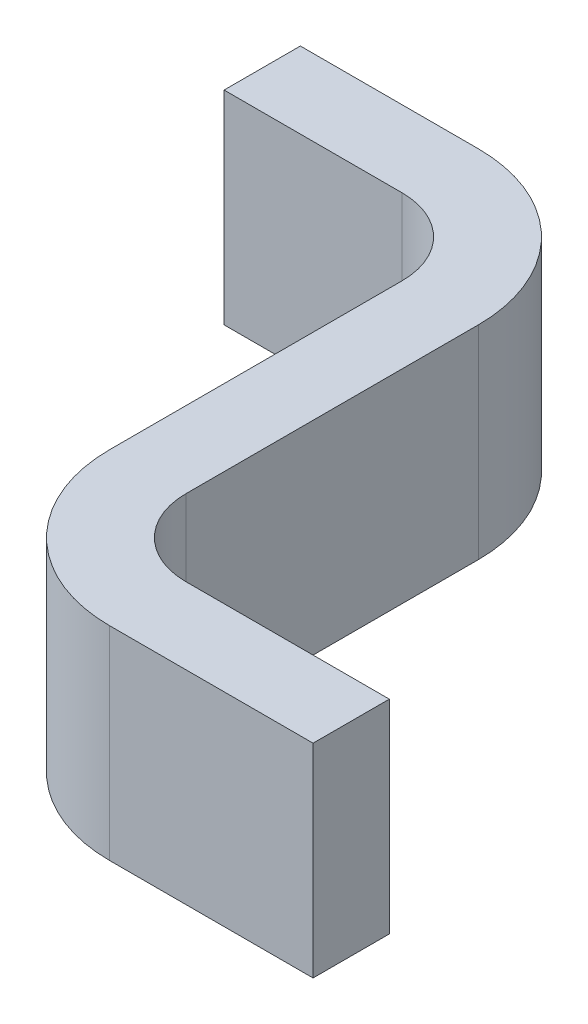
ISO-10303-21;
HEADER;
FILE_DESCRIPTION(('STEP AP214'),'2;1');
FILE_NAME('part.step','',(''),(''),'','','');
FILE_SCHEMA(('AUTOMOTIVE_DESIGN { 1 0 10303 214 1 1 1 1 }'));
ENDSEC;
DATA;
#1=APPLICATION_CONTEXT('core data for automotive mechanical design processes');
#2=APPLICATION_PROTOCOL_DEFINITION('international standard','automotive_design',2000,#1);
#3=PRODUCT_CONTEXT('',#1,'mechanical');
#4=PRODUCT('Part','Part','',(#3));
#5=PRODUCT_RELATED_PRODUCT_CATEGORY('part','',(#4));
#6=PRODUCT_DEFINITION_FORMATION('','',#4);
#7=PRODUCT_DEFINITION_CONTEXT('part definition',#1,'design');
#8=PRODUCT_DEFINITION('design','',#6,#7);
#9=PRODUCT_DEFINITION_SHAPE('','',#8);
#10=(LENGTH_UNIT() NAMED_UNIT(*) SI_UNIT(.MILLI.,.METRE.));
#11=(NAMED_UNIT(*) PLANE_ANGLE_UNIT() SI_UNIT($,.RADIAN.));
#12=(NAMED_UNIT(*) SI_UNIT($,.STERADIAN.) SOLID_ANGLE_UNIT());
#13=UNCERTAINTY_MEASURE_WITH_UNIT(LENGTH_MEASURE(1.E-05),#10,'distance_accuracy_value','');
#14=(GEOMETRIC_REPRESENTATION_CONTEXT(3) GLOBAL_UNCERTAINTY_ASSIGNED_CONTEXT((#13)) GLOBAL_UNIT_ASSIGNED_CONTEXT((#10,
#11,#12)) REPRESENTATION_CONTEXT('',''));
#15=CARTESIAN_POINT('',(0.,0.,0.));
#16=DIRECTION('',(0.,0.,1.));
#17=DIRECTION('',(1.,0.,0.));
#18=AXIS2_PLACEMENT_3D('',#15,#16,#17);
#19=CARTESIAN_POINT('',(-2.825,-1.07,1.175));
#20=DIRECTION('',(0.,1.,0.));
#21=DIRECTION('',(1.,0.,0.));
#22=AXIS2_PLACEMENT_3D('',#19,#20,#21);
#23=PLANE('',#22);
#24=DIRECTION('',(0.,0.,1.));
#25=VECTOR('',#24,1.);
#26=CARTESIAN_POINT('',(-2.75,-1.07,1.175));
#27=LINE('',#26,#25);
#28=CARTESIAN_POINT('',(-2.75,-1.07,0.3));
#29=VERTEX_POINT('',#28);
#30=CARTESIAN_POINT('',(-2.75,-1.07,0.875));
#31=VERTEX_POINT('',#30);
#32=EDGE_CURVE('E184',#29,#31,#27,.T.);
#33=ORIENTED_EDGE('',*,*,#32,.F.);
#34=CARTESIAN_POINT('',(-3.05,-1.07,0.3));
#35=DIRECTION('',(0.,-1.,0.));
#36=DIRECTION('',(0.,0.,1.));
#37=AXIS2_PLACEMENT_3D('',#34,#35,#36);
#38=CIRCLE('',#37,0.3);
#39=CARTESIAN_POINT('',(-3.05,-1.07,0.));
#40=VERTEX_POINT('',#39);
#41=EDGE_CURVE('E183',#40,#29,#38,.T.);
#42=ORIENTED_EDGE('',*,*,#41,.F.);
#43=DIRECTION('',(-1.,0.,0.));
#44=VECTOR('',#43,1.);
#45=CARTESIAN_POINT('',(-2.475,-1.07,0.));
#46=LINE('',#45,#44);
#47=CARTESIAN_POINT('',(-3.4,-1.07,0.));
#48=VERTEX_POINT('',#47);
#49=EDGE_CURVE('E233',#40,#48,#46,.T.);
#50=ORIENTED_EDGE('',*,*,#49,.T.);
#51=DIRECTION('',(0.,0.,-1.));
#52=VECTOR('',#51,1.);
#53=CARTESIAN_POINT('',(-3.4,-1.07,0.));
#54=LINE('',#53,#52);
#55=CARTESIAN_POINT('',(-3.4,-1.07,0.15));
#56=VERTEX_POINT('',#55);
#57=EDGE_CURVE('E241',#56,#48,#54,.T.);
#58=ORIENTED_EDGE('',*,*,#57,.F.);
#59=DIRECTION('',(-1.,0.,0.));
#60=VECTOR('',#59,1.);
#61=CARTESIAN_POINT('',(0.,-1.07,0.15));
#62=LINE('',#61,#60);
#63=CARTESIAN_POINT('',(-3.05,-1.07,0.15));
#64=VERTEX_POINT('',#63);
#65=EDGE_CURVE('E248',#64,#56,#62,.T.);
#66=ORIENTED_EDGE('',*,*,#65,.F.);
#67=CARTESIAN_POINT('',(-3.05,-1.07,0.3));
#68=DIRECTION('',(0.,-1.,0.));
#69=DIRECTION('',(0.,0.,1.));
#70=AXIS2_PLACEMENT_3D('',#67,#68,#69);
#71=CIRCLE('',#70,0.15);
#72=CARTESIAN_POINT('',(-2.9,-1.07,0.3));
#73=VERTEX_POINT('',#72);
#74=EDGE_CURVE('E172',#64,#73,#71,.T.);
#75=ORIENTED_EDGE('',*,*,#74,.T.);
#76=DIRECTION('',(0.,0.,-1.));
#77=VECTOR('',#76,1.);
#78=CARTESIAN_POINT('',(-2.9,-1.07,1.175));
#79=LINE('',#78,#77);
#80=CARTESIAN_POINT('',(-2.9,-1.07,0.875));
#81=VERTEX_POINT('',#80);
#82=EDGE_CURVE('E144',#81,#73,#79,.T.);
#83=ORIENTED_EDGE('',*,*,#82,.F.);
#84=CARTESIAN_POINT('',(-2.6,-1.07,0.875));
#85=DIRECTION('',(0.,-1.,0.));
#86=DIRECTION('',(0.,0.,-1.));
#87=AXIS2_PLACEMENT_3D('',#84,#85,#86);
#88=CIRCLE('',#87,0.3);
#89=CARTESIAN_POINT('',(-2.6,-1.07,1.175));
#90=VERTEX_POINT('',#89);
#91=EDGE_CURVE('E143',#90,#81,#88,.T.);
#92=ORIENTED_EDGE('',*,*,#91,.F.);
#93=DIRECTION('',(-1.,0.,0.));
#94=VECTOR('',#93,1.);
#95=CARTESIAN_POINT('',(-2.475,-1.07,1.175));
#96=LINE('',#95,#94);
#97=CARTESIAN_POINT('',(-2.2,-1.07,1.175));
#98=VERTEX_POINT('',#97);
#99=EDGE_CURVE('E25',#98,#90,#96,.T.);
#100=ORIENTED_EDGE('',*,*,#99,.F.);
#101=DIRECTION('',(0.,0.,1.));
#102=VECTOR('',#101,1.);
#103=CARTESIAN_POINT('',(-2.2,-1.07,1.1));
#104=LINE('',#103,#102);
#105=CARTESIAN_POINT('',(-2.2,-1.07,1.025));
#106=VERTEX_POINT('',#105);
#107=EDGE_CURVE('E11',#106,#98,#104,.T.);
#108=ORIENTED_EDGE('',*,*,#107,.F.);
#109=DIRECTION('',(-1.,0.,0.));
#110=VECTOR('',#109,1.);
#111=CARTESIAN_POINT('',(0.,-1.07,1.025));
#112=LINE('',#111,#110);
#113=CARTESIAN_POINT('',(-2.6,-1.07,1.025));
#114=VERTEX_POINT('',#113);
#115=EDGE_CURVE('E173',#106,#114,#112,.T.);
#116=ORIENTED_EDGE('',*,*,#115,.T.);
#117=CARTESIAN_POINT('',(-2.6,-1.07,0.875));
#118=DIRECTION('',(0.,-1.,0.));
#119=DIRECTION('',(0.,0.,1.));
#120=AXIS2_PLACEMENT_3D('',#117,#118,#119);
#121=CIRCLE('',#120,0.15);
#122=EDGE_CURVE('E199',#114,#31,#121,.T.);
#123=ORIENTED_EDGE('',*,*,#122,.T.);
#124=EDGE_LOOP('',(#33,#42,#50,#58,#66,#75,#83,#92,#100,#108,#116,#123));
#125=FACE_BOUND('',#124,.T.);
#126=ADVANCED_FACE('F17',(#125),#23,.T.);
#127=CARTESIAN_POINT('',(-2.2,-1.27,1.1));
#128=DIRECTION('',(1.,0.,0.));
#129=DIRECTION('',(0.,1.,0.));
#130=AXIS2_PLACEMENT_3D('',#127,#128,#129);
#131=PLANE('',#130);
#132=DIRECTION('',(0.,1.,0.));
#133=VECTOR('',#132,1.);
#134=CARTESIAN_POINT('',(-2.2,1.27,1.175));
#135=LINE('',#134,#133);
#136=CARTESIAN_POINT('',(-2.2,-1.47,1.175));
#137=VERTEX_POINT('',#136);
#138=EDGE_CURVE('E202',#137,#98,#135,.T.);
#139=ORIENTED_EDGE('',*,*,#138,.F.);
#140=DIRECTION('',(0.,0.,1.));
#141=VECTOR('',#140,1.);
#142=CARTESIAN_POINT('',(-2.2,-1.47,0.));
#143=LINE('',#142,#141);
#144=CARTESIAN_POINT('',(-2.2,-1.47,1.025));
#145=VERTEX_POINT('',#144);
#146=EDGE_CURVE('E161',#145,#137,#143,.T.);
#147=ORIENTED_EDGE('',*,*,#146,.F.);
#148=DIRECTION('',(0.,1.,0.));
#149=VECTOR('',#148,1.);
#150=CARTESIAN_POINT('',(-2.2,0.,1.025));
#151=LINE('',#150,#149);
#152=EDGE_CURVE('E176',#145,#106,#151,.T.);
#153=ORIENTED_EDGE('',*,*,#152,.T.);
#154=ORIENTED_EDGE('',*,*,#107,.T.);
#155=EDGE_LOOP('',(#139,#147,#153,#154));
#156=FACE_BOUND('',#155,.T.);
#157=ADVANCED_FACE('F262',(#156),#131,.T.);
#158=CARTESIAN_POINT('',(-2.475,1.27,1.175));
#159=DIRECTION('',(0.,0.,1.));
#160=DIRECTION('',(1.,0.,0.));
#161=AXIS2_PLACEMENT_3D('',#158,#159,#160);
#162=PLANE('',#161);
#163=ORIENTED_EDGE('',*,*,#138,.T.);
#164=ORIENTED_EDGE('',*,*,#99,.T.);
#165=DIRECTION('',(0.,1.,0.));
#166=VECTOR('',#165,1.);
#167=CARTESIAN_POINT('',(-2.6,0.,1.175));
#168=LINE('',#167,#166);
#169=CARTESIAN_POINT('',(-2.6,-1.47,1.175));
#170=VERTEX_POINT('',#169);
#171=EDGE_CURVE('E135',#170,#90,#168,.T.);
#172=ORIENTED_EDGE('',*,*,#171,.F.);
#173=DIRECTION('',(-1.,0.,0.));
#174=VECTOR('',#173,1.);
#175=CARTESIAN_POINT('',(-3.15,-1.47,1.175));
#176=LINE('',#175,#174);
#177=EDGE_CURVE('E139',#137,#170,#176,.T.);
#178=ORIENTED_EDGE('',*,*,#177,.F.);
#179=EDGE_LOOP('',(#163,#164,#172,#178));
#180=FACE_BOUND('',#179,.T.);
#181=ADVANCED_FACE('F137',(#180),#162,.T.);
#182=CARTESIAN_POINT('',(-2.6,0.,0.875));
#183=DIRECTION('',(0.,-1.,0.));
#184=DIRECTION('',(0.,0.,-1.));
#185=AXIS2_PLACEMENT_3D('',#182,#183,#184);
#186=CYLINDRICAL_SURFACE('',#185,0.3);
#187=DIRECTION('',(0.,1.,0.));
#188=VECTOR('',#187,1.);
#189=CARTESIAN_POINT('',(-2.9,-1.27,0.875));
#190=LINE('',#189,#188);
#191=CARTESIAN_POINT('',(-2.9,-1.47,0.875));
#192=VERTEX_POINT('',#191);
#193=EDGE_CURVE('E150',#192,#81,#190,.T.);
#194=ORIENTED_EDGE('',*,*,#193,.F.);
#195=CARTESIAN_POINT('',(-2.6,-1.47,0.875));
#196=DIRECTION('',(0.,-1.,0.));
#197=DIRECTION('',(0.,0.,-1.));
#198=AXIS2_PLACEMENT_3D('',#195,#196,#197);
#199=CIRCLE('',#198,0.3);
#200=EDGE_CURVE('E147',#170,#192,#199,.T.);
#201=ORIENTED_EDGE('',*,*,#200,.F.);
#202=ORIENTED_EDGE('',*,*,#171,.T.);
#203=ORIENTED_EDGE('',*,*,#91,.T.);
#204=EDGE_LOOP('',(#194,#201,#202,#203));
#205=FACE_BOUND('',#204,.T.);
#206=ADVANCED_FACE('F148',(#205),#186,.T.);
#207=CARTESIAN_POINT('',(-2.9,-1.27,1.175));
#208=DIRECTION('',(-1.,0.,0.));
#209=DIRECTION('',(0.,0.,1.));
#210=AXIS2_PLACEMENT_3D('',#207,#208,#209);
#211=PLANE('',#210);
#212=ORIENTED_EDGE('',*,*,#193,.T.);
#213=ORIENTED_EDGE('',*,*,#82,.T.);
#214=DIRECTION('',(0.,-1.,0.));
#215=VECTOR('',#214,1.);
#216=CARTESIAN_POINT('',(-2.9,-0.635,0.3));
#217=LINE('',#216,#215);
#218=CARTESIAN_POINT('',(-2.9,-1.47,0.3));
#219=VERTEX_POINT('',#218);
#220=EDGE_CURVE('E251',#73,#219,#217,.T.);
#221=ORIENTED_EDGE('',*,*,#220,.T.);
#222=DIRECTION('',(0.,0.,-1.));
#223=VECTOR('',#222,1.);
#224=CARTESIAN_POINT('',(-2.9,-1.47,0.));
#225=LINE('',#224,#223);
#226=EDGE_CURVE('E155',#192,#219,#225,.T.);
#227=ORIENTED_EDGE('',*,*,#226,.F.);
#228=EDGE_LOOP('',(#212,#213,#221,#227));
#229=FACE_BOUND('',#228,.T.);
#230=ADVANCED_FACE('F303',(#229),#211,.T.);
#231=CARTESIAN_POINT('',(-3.05,-0.635,0.3));
#232=DIRECTION('',(0.,1.,0.));
#233=DIRECTION('',(0.,0.,1.));
#234=AXIS2_PLACEMENT_3D('',#231,#232,#233);
#235=CYLINDRICAL_SURFACE('',#234,0.15);
#236=ORIENTED_EDGE('',*,*,#74,.F.);
#237=DIRECTION('',(0.,1.,0.));
#238=VECTOR('',#237,1.);
#239=CARTESIAN_POINT('',(-3.05,0.,0.15));
#240=LINE('',#239,#238);
#241=CARTESIAN_POINT('',(-3.05,-1.47,0.15));
#242=VERTEX_POINT('',#241);
#243=EDGE_CURVE('E244',#242,#64,#240,.T.);
#244=ORIENTED_EDGE('',*,*,#243,.F.);
#245=CARTESIAN_POINT('',(-3.05,-1.47,0.3));
#246=DIRECTION('',(0.,1.,0.));
#247=DIRECTION('',(0.,0.,1.));
#248=AXIS2_PLACEMENT_3D('',#245,#246,#247);
#249=CIRCLE('',#248,0.15);
#250=EDGE_CURVE('E187',#219,#242,#249,.T.);
#251=ORIENTED_EDGE('',*,*,#250,.F.);
#252=ORIENTED_EDGE('',*,*,#220,.F.);
#253=EDGE_LOOP('',(#236,#244,#251,#252));
#254=FACE_BOUND('',#253,.T.);
#255=ADVANCED_FACE('F307',(#254),#235,.F.);
#256=CARTESIAN_POINT('',(0.,0.,0.15));
#257=DIRECTION('',(0.,0.,1.));
#258=DIRECTION('',(1.,0.,0.));
#259=AXIS2_PLACEMENT_3D('',#256,#257,#258);
#260=PLANE('',#259);
#261=DIRECTION('',(0.,1.,0.));
#262=VECTOR('',#261,1.);
#263=CARTESIAN_POINT('',(-3.4,-1.27,0.15));
#264=LINE('',#263,#262);
#265=CARTESIAN_POINT('',(-3.4,-1.47,0.15));
#266=VERTEX_POINT('',#265);
#267=EDGE_CURVE('E237',#266,#56,#264,.T.);
#268=ORIENTED_EDGE('',*,*,#267,.F.);
#269=DIRECTION('',(-1.,0.,0.));
#270=VECTOR('',#269,1.);
#271=CARTESIAN_POINT('',(-3.15,-1.47,0.15));
#272=LINE('',#271,#270);
#273=EDGE_CURVE('E191',#242,#266,#272,.T.);
#274=ORIENTED_EDGE('',*,*,#273,.F.);
#275=ORIENTED_EDGE('',*,*,#243,.T.);
#276=ORIENTED_EDGE('',*,*,#65,.T.);
#277=EDGE_LOOP('',(#268,#274,#275,#276));
#278=FACE_BOUND('',#277,.T.);
#279=ADVANCED_FACE('F309',(#278),#260,.T.);
#280=CARTESIAN_POINT('',(-3.4,-1.27,0.));
#281=DIRECTION('',(-1.,0.,0.));
#282=DIRECTION('',(0.,0.,1.));
#283=AXIS2_PLACEMENT_3D('',#280,#281,#282);
#284=PLANE('',#283);
#285=DIRECTION('',(0.,-1.,0.));
#286=VECTOR('',#285,1.);
#287=CARTESIAN_POINT('',(-3.4,1.27,0.));
#288=LINE('',#287,#286);
#289=CARTESIAN_POINT('',(-3.4,-1.47,0.));
#290=VERTEX_POINT('',#289);
#291=EDGE_CURVE('E230',#48,#290,#288,.T.);
#292=ORIENTED_EDGE('',*,*,#291,.T.);
#293=DIRECTION('',(0.,0.,-1.));
#294=VECTOR('',#293,1.);
#295=CARTESIAN_POINT('',(-3.4,-1.47,0.));
#296=LINE('',#295,#294);
#297=EDGE_CURVE('E195',#266,#290,#296,.T.);
#298=ORIENTED_EDGE('',*,*,#297,.F.);
#299=ORIENTED_EDGE('',*,*,#267,.T.);
#300=ORIENTED_EDGE('',*,*,#57,.T.);
#301=EDGE_LOOP('',(#292,#298,#299,#300));
#302=FACE_BOUND('',#301,.T.);
#303=ADVANCED_FACE('F312',(#302),#284,.T.);
#304=CARTESIAN_POINT('',(-2.475,1.27,0.));
#305=DIRECTION('',(0.,0.,1.));
#306=DIRECTION('',(1.,0.,0.));
#307=AXIS2_PLACEMENT_3D('',#304,#305,#306);
#308=PLANE('',#307);
#309=DIRECTION('',(1.,0.,0.));
#310=VECTOR('',#309,1.);
#311=CARTESIAN_POINT('',(-3.15,-1.47,0.));
#312=LINE('',#311,#310);
#313=CARTESIAN_POINT('',(-3.05,-1.47,0.));
#314=VERTEX_POINT('',#313);
#315=EDGE_CURVE('E206',#290,#314,#312,.T.);
#316=ORIENTED_EDGE('',*,*,#315,.F.);
#317=ORIENTED_EDGE('',*,*,#291,.F.);
#318=ORIENTED_EDGE('',*,*,#49,.F.);
#319=DIRECTION('',(0.,1.,0.));
#320=VECTOR('',#319,1.);
#321=CARTESIAN_POINT('',(-3.05,0.,0.));
#322=LINE('',#321,#320);
#323=EDGE_CURVE('E179',#314,#40,#322,.T.);
#324=ORIENTED_EDGE('',*,*,#323,.F.);
#325=EDGE_LOOP('',(#316,#317,#318,#324));
#326=FACE_BOUND('',#325,.T.);
#327=ADVANCED_FACE('F285',(#326),#308,.F.);
#328=CARTESIAN_POINT('',(-3.05,0.,0.3));
#329=DIRECTION('',(0.,1.,0.));
#330=DIRECTION('',(0.,0.,1.));
#331=AXIS2_PLACEMENT_3D('',#328,#329,#330);
#332=CYLINDRICAL_SURFACE('',#331,0.3);
#333=DIRECTION('',(0.,1.,0.));
#334=VECTOR('',#333,1.);
#335=CARTESIAN_POINT('',(-2.75,-1.27,0.3));
#336=LINE('',#335,#334);
#337=CARTESIAN_POINT('',(-2.75,-1.47,0.3));
#338=VERTEX_POINT('',#337);
#339=EDGE_CURVE('E222',#338,#29,#336,.T.);
#340=ORIENTED_EDGE('',*,*,#339,.F.);
#341=CARTESIAN_POINT('',(-3.05,-1.47,0.3));
#342=DIRECTION('',(0.,-1.,0.));
#343=DIRECTION('',(0.,0.,1.));
#344=AXIS2_PLACEMENT_3D('',#341,#342,#343);
#345=CIRCLE('',#344,0.3);
#346=EDGE_CURVE('E207',#314,#338,#345,.T.);
#347=ORIENTED_EDGE('',*,*,#346,.F.);
#348=ORIENTED_EDGE('',*,*,#323,.T.);
#349=ORIENTED_EDGE('',*,*,#41,.T.);
#350=EDGE_LOOP('',(#340,#347,#348,#349));
#351=FACE_BOUND('',#350,.T.);
#352=ADVANCED_FACE('F288',(#351),#332,.T.);
#353=CARTESIAN_POINT('',(-2.75,-1.27,1.175));
#354=DIRECTION('',(1.,0.,0.));
#355=DIRECTION('',(0.,1.,0.));
#356=AXIS2_PLACEMENT_3D('',#353,#354,#355);
#357=PLANE('',#356);
#358=ORIENTED_EDGE('',*,*,#339,.T.);
#359=ORIENTED_EDGE('',*,*,#32,.T.);
#360=DIRECTION('',(0.,-1.,0.));
#361=VECTOR('',#360,1.);
#362=CARTESIAN_POINT('',(-2.75,-0.635,0.875));
#363=LINE('',#362,#361);
#364=CARTESIAN_POINT('',(-2.75,-1.47,0.875));
#365=VERTEX_POINT('',#364);
#366=EDGE_CURVE('E214',#31,#365,#363,.T.);
#367=ORIENTED_EDGE('',*,*,#366,.T.);
#368=DIRECTION('',(0.,0.,1.));
#369=VECTOR('',#368,1.);
#370=CARTESIAN_POINT('',(-2.75,-1.47,0.));
#371=LINE('',#370,#369);
#372=EDGE_CURVE('E177',#338,#365,#371,.T.);
#373=ORIENTED_EDGE('',*,*,#372,.F.);
#374=EDGE_LOOP('',(#358,#359,#367,#373));
#375=FACE_BOUND('',#374,.T.);
#376=ADVANCED_FACE('F292',(#375),#357,.T.);
#377=CARTESIAN_POINT('',(-2.6,-0.635,0.875));
#378=DIRECTION('',(0.,1.,0.));
#379=DIRECTION('',(0.,0.,1.));
#380=AXIS2_PLACEMENT_3D('',#377,#378,#379);
#381=CYLINDRICAL_SURFACE('',#380,0.15);
#382=ORIENTED_EDGE('',*,*,#122,.F.);
#383=DIRECTION('',(0.,-1.,0.));
#384=VECTOR('',#383,1.);
#385=CARTESIAN_POINT('',(-2.6,0.,1.025));
#386=LINE('',#385,#384);
#387=CARTESIAN_POINT('',(-2.6,-1.47,1.025));
#388=VERTEX_POINT('',#387);
#389=EDGE_CURVE('E196',#114,#388,#386,.T.);
#390=ORIENTED_EDGE('',*,*,#389,.T.);
#391=CARTESIAN_POINT('',(-2.6,-1.47,0.875));
#392=DIRECTION('',(0.,1.,0.));
#393=DIRECTION('',(0.,0.,1.));
#394=AXIS2_PLACEMENT_3D('',#391,#392,#393);
#395=CIRCLE('',#394,0.15);
#396=EDGE_CURVE('E266',#365,#388,#395,.T.);
#397=ORIENTED_EDGE('',*,*,#396,.F.);
#398=ORIENTED_EDGE('',*,*,#366,.F.);
#399=EDGE_LOOP('',(#382,#390,#397,#398));
#400=FACE_BOUND('',#399,.T.);
#401=ADVANCED_FACE('F295',(#400),#381,.F.);
#402=CARTESIAN_POINT('',(0.,0.,1.025));
#403=DIRECTION('',(0.,0.,1.));
#404=DIRECTION('',(1.,0.,0.));
#405=AXIS2_PLACEMENT_3D('',#402,#403,#404);
#406=PLANE('',#405);
#407=ORIENTED_EDGE('',*,*,#115,.F.);
#408=ORIENTED_EDGE('',*,*,#152,.F.);
#409=DIRECTION('',(1.,0.,0.));
#410=VECTOR('',#409,1.);
#411=CARTESIAN_POINT('',(-3.15,-1.47,1.025));
#412=LINE('',#411,#410);
#413=EDGE_CURVE('E168',#388,#145,#412,.T.);
#414=ORIENTED_EDGE('',*,*,#413,.F.);
#415=ORIENTED_EDGE('',*,*,#389,.F.);
#416=EDGE_LOOP('',(#407,#408,#414,#415));
#417=FACE_BOUND('',#416,.T.);
#418=ADVANCED_FACE('F296',(#417),#406,.F.);
#419=CARTESIAN_POINT('',(-3.15,-1.47,0.));
#420=DIRECTION('',(0.,-1.,0.));
#421=DIRECTION('',(0.,0.,-1.));
#422=AXIS2_PLACEMENT_3D('',#419,#420,#421);
#423=PLANE('',#422);
#424=ORIENTED_EDGE('',*,*,#396,.T.);
#425=ORIENTED_EDGE('',*,*,#413,.T.);
#426=ORIENTED_EDGE('',*,*,#146,.T.);
#427=ORIENTED_EDGE('',*,*,#177,.T.);
#428=ORIENTED_EDGE('',*,*,#200,.T.);
#429=ORIENTED_EDGE('',*,*,#226,.T.);
#430=ORIENTED_EDGE('',*,*,#250,.T.);
#431=ORIENTED_EDGE('',*,*,#273,.T.);
#432=ORIENTED_EDGE('',*,*,#297,.T.);
#433=ORIENTED_EDGE('',*,*,#315,.T.);
#434=ORIENTED_EDGE('',*,*,#346,.T.);
#435=ORIENTED_EDGE('',*,*,#372,.T.);
#436=EDGE_LOOP('',(#424,#425,#426,#427,#428,#429,#430,#431,#432,#433,#434,#435));
#437=FACE_BOUND('',#436,.T.);
#438=ADVANCED_FACE('F158',(#437),#423,.T.);
#439=CLOSED_SHELL('',(#126,#157,#181,#206,#230,#255,#279,#303,#327,#352,#376,#401,#418,#438));
#440=MANIFOLD_SOLID_BREP('B1',#439);
#441=ADVANCED_BREP_SHAPE_REPRESENTATION('',(#18,#440),#14);
#442=SHAPE_DEFINITION_REPRESENTATION(#9,#441);
ENDSEC;
END-ISO-10303-21;
